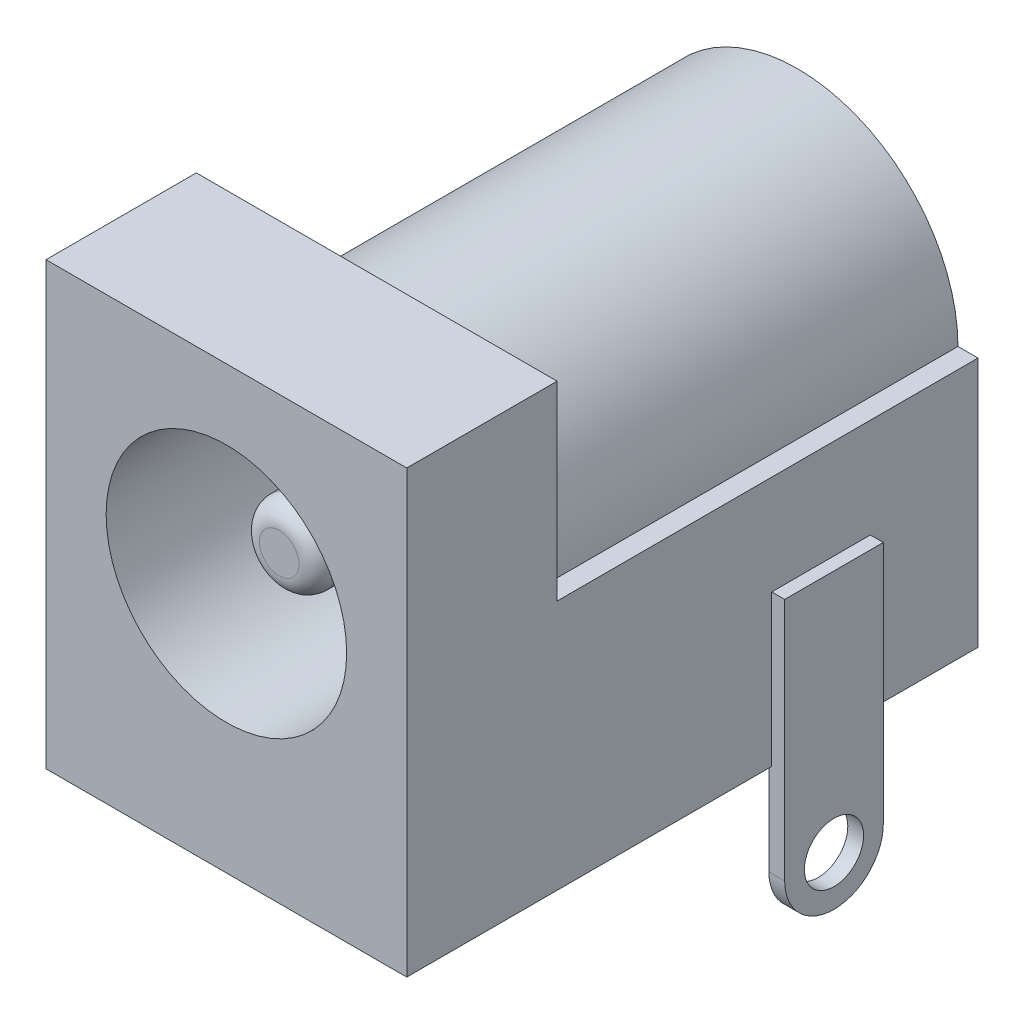
ISO-10303-21;
HEADER;
FILE_DESCRIPTION(('STEP AP214'),'2;1');
FILE_NAME('part.step','',(''),(''),'','','');
FILE_SCHEMA(('AUTOMOTIVE_DESIGN { 1 0 10303 214 1 1 1 1 }'));
ENDSEC;
DATA;
#1=APPLICATION_CONTEXT('core data for automotive mechanical design processes');
#2=APPLICATION_PROTOCOL_DEFINITION('international standard','automotive_design',2000,#1);
#3=PRODUCT_CONTEXT('',#1,'mechanical');
#4=PRODUCT('Part','Part','',(#3));
#5=PRODUCT_RELATED_PRODUCT_CATEGORY('part','',(#4));
#6=PRODUCT_DEFINITION_FORMATION('','',#4);
#7=PRODUCT_DEFINITION_CONTEXT('part definition',#1,'design');
#8=PRODUCT_DEFINITION('design','',#6,#7);
#9=PRODUCT_DEFINITION_SHAPE('','',#8);
#10=(LENGTH_UNIT() NAMED_UNIT(*) SI_UNIT(.MILLI.,.METRE.));
#11=(NAMED_UNIT(*) PLANE_ANGLE_UNIT() SI_UNIT($,.RADIAN.));
#12=(NAMED_UNIT(*) SI_UNIT($,.STERADIAN.) SOLID_ANGLE_UNIT());
#13=UNCERTAINTY_MEASURE_WITH_UNIT(LENGTH_MEASURE(1.E-05),#10,'distance_accuracy_value','');
#14=(GEOMETRIC_REPRESENTATION_CONTEXT(3) GLOBAL_UNCERTAINTY_ASSIGNED_CONTEXT((#13)) GLOBAL_UNIT_ASSIGNED_CONTEXT((#10,
#11,#12)) REPRESENTATION_CONTEXT('',''));
#15=CARTESIAN_POINT('',(0.,0.,0.));
#16=DIRECTION('',(0.,0.,1.));
#17=DIRECTION('',(1.,0.,0.));
#18=AXIS2_PLACEMENT_3D('',#15,#16,#17);
#19=CARTESIAN_POINT('',(-4.572,0.,-3.81));
#20=DIRECTION('',(0.,-1.,0.));
#21=DIRECTION('',(1.,0.,0.));
#22=AXIS2_PLACEMENT_3D('',#19,#20,#21);
#23=PLANE('',#22);
#24=DIRECTION('',(-1.,0.,0.));
#25=VECTOR('',#24,1.);
#26=CARTESIAN_POINT('',(-1.1,0.,-7.65));
#27=LINE('',#26,#25);
#28=CARTESIAN_POINT('',(1.1,0.,-7.65));
#29=VERTEX_POINT('',#28);
#30=CARTESIAN_POINT('',(-1.1,0.,-7.65));
#31=VERTEX_POINT('',#30);
#32=EDGE_CURVE('E59',#29,#31,#27,.T.);
#33=ORIENTED_EDGE('',*,*,#32,.T.);
#34=DIRECTION('',(0.,0.,-1.));
#35=VECTOR('',#34,1.);
#36=CARTESIAN_POINT('',(-1.1,0.,-7.35));
#37=LINE('',#36,#35);
#38=CARTESIAN_POINT('',(-1.1,0.,-7.35));
#39=VERTEX_POINT('',#38);
#40=EDGE_CURVE('E245',#39,#31,#37,.T.);
#41=ORIENTED_EDGE('',*,*,#40,.F.);
#42=DIRECTION('',(-1.,0.,0.));
#43=VECTOR('',#42,1.);
#44=CARTESIAN_POINT('',(-1.1,0.,-7.35));
#45=LINE('',#44,#43);
#46=CARTESIAN_POINT('',(1.1,0.,-7.35));
#47=VERTEX_POINT('',#46);
#48=EDGE_CURVE('E220',#47,#39,#45,.T.);
#49=ORIENTED_EDGE('',*,*,#48,.F.);
#50=DIRECTION('',(0.,0.,-1.));
#51=VECTOR('',#50,1.);
#52=CARTESIAN_POINT('',(1.1,0.,-7.35));
#53=LINE('',#52,#51);
#54=EDGE_CURVE('E230',#47,#29,#53,.T.);
#55=ORIENTED_EDGE('',*,*,#54,.T.);
#56=EDGE_LOOP('',(#33,#41,#49,#55));
#57=FACE_BOUND('',#56,.T.);
#58=DIRECTION('',(0.,0.,-1.));
#59=VECTOR('',#58,1.);
#60=CARTESIAN_POINT('',(4.5,0.,-3.81));
#61=LINE('',#60,#59);
#62=CARTESIAN_POINT('',(4.5,0.,-9.2499999999999));
#63=VERTEX_POINT('',#62);
#64=CARTESIAN_POINT('',(4.5,0.,-11.7499999999999));
#65=VERTEX_POINT('',#64);
#66=EDGE_CURVE('E352',#63,#65,#61,.T.);
#67=ORIENTED_EDGE('',*,*,#66,.F.);
#68=DIRECTION('',(1.,0.,0.));
#69=VECTOR('',#68,1.);
#70=CARTESIAN_POINT('',(-4.572,0.,-9.2499999999999));
#71=LINE('',#70,#69);
#72=CARTESIAN_POINT('',(4.572,0.,-9.2499999999999));
#73=VERTEX_POINT('',#72);
#74=EDGE_CURVE('E44',#63,#73,#71,.T.);
#75=ORIENTED_EDGE('',*,*,#74,.T.);
#76=DIRECTION('',(0.,0.,1.));
#77=VECTOR('',#76,1.);
#78=CARTESIAN_POINT('',(4.572,0.,-3.81));
#79=LINE('',#78,#77);
#80=CARTESIAN_POINT('',(4.572,0.,0.));
#81=VERTEX_POINT('',#80);
#82=EDGE_CURVE('E359',#73,#81,#79,.T.);
#83=ORIENTED_EDGE('',*,*,#82,.T.);
#84=DIRECTION('',(1.,0.,0.));
#85=VECTOR('',#84,1.);
#86=CARTESIAN_POINT('',(-4.572,0.,0.));
#87=LINE('',#86,#85);
#88=CARTESIAN_POINT('',(-4.572,0.,0.));
#89=VERTEX_POINT('',#88);
#90=EDGE_CURVE('E389',#89,#81,#87,.T.);
#91=ORIENTED_EDGE('',*,*,#90,.F.);
#92=DIRECTION('',(0.,0.,1.));
#93=VECTOR('',#92,1.);
#94=CARTESIAN_POINT('',(-4.572,0.,-3.81));
#95=LINE('',#94,#93);
#96=CARTESIAN_POINT('',(-4.572,0.,-14.478));
#97=VERTEX_POINT('',#96);
#98=EDGE_CURVE('E369',#97,#89,#95,.T.);
#99=ORIENTED_EDGE('',*,*,#98,.F.);
#100=DIRECTION('',(-1.,0.,0.));
#101=VECTOR('',#100,1.);
#102=CARTESIAN_POINT('',(-4.572,0.,-14.478));
#103=LINE('',#102,#101);
#104=CARTESIAN_POINT('',(4.572,0.,-14.478));
#105=VERTEX_POINT('',#104);
#106=EDGE_CURVE('E306',#105,#97,#103,.T.);
#107=ORIENTED_EDGE('',*,*,#106,.F.);
#108=CARTESIAN_POINT('',(4.572,0.,-11.7499999999999));
#109=VERTEX_POINT('',#108);
#110=EDGE_CURVE('E368',#105,#109,#79,.T.);
#111=ORIENTED_EDGE('',*,*,#110,.T.);
#112=DIRECTION('',(-1.,0.,0.));
#113=VECTOR('',#112,1.);
#114=CARTESIAN_POINT('',(-4.572,0.,-11.7499999999999));
#115=LINE('',#114,#113);
#116=EDGE_CURVE('E349',#109,#65,#115,.T.);
#117=ORIENTED_EDGE('',*,*,#116,.T.);
#118=EDGE_LOOP('',(#67,#75,#83,#91,#99,#107,#111,#117));
#119=FACE_BOUND('',#118,.T.);
#120=DIRECTION('',(-1.,0.,0.));
#121=VECTOR('',#120,1.);
#122=CARTESIAN_POINT('',(1.425,0.,-13.9));
#123=LINE('',#122,#121);
#124=CARTESIAN_POINT('',(1.425,0.,-13.9));
#125=VERTEX_POINT('',#124);
#126=CARTESIAN_POINT('',(-1.425,0.,-13.9));
#127=VERTEX_POINT('',#126);
#128=EDGE_CURVE('E51',#125,#127,#123,.T.);
#129=ORIENTED_EDGE('',*,*,#128,.T.);
#130=DIRECTION('',(0.,0.,-1.));
#131=VECTOR('',#130,1.);
#132=CARTESIAN_POINT('',(-1.425,0.,-13.5));
#133=LINE('',#132,#131);
#134=CARTESIAN_POINT('',(-1.425,0.,-13.5));
#135=VERTEX_POINT('',#134);
#136=EDGE_CURVE('E191',#135,#127,#133,.T.);
#137=ORIENTED_EDGE('',*,*,#136,.F.);
#138=DIRECTION('',(-1.,0.,0.));
#139=VECTOR('',#138,1.);
#140=CARTESIAN_POINT('',(1.425,0.,-13.5));
#141=LINE('',#140,#139);
#142=CARTESIAN_POINT('',(1.425,0.,-13.5));
#143=VERTEX_POINT('',#142);
#144=EDGE_CURVE('E197',#143,#135,#141,.T.);
#145=ORIENTED_EDGE('',*,*,#144,.F.);
#146=DIRECTION('',(0.,0.,-1.));
#147=VECTOR('',#146,1.);
#148=CARTESIAN_POINT('',(1.425,0.,-13.5));
#149=LINE('',#148,#147);
#150=EDGE_CURVE('E698',#143,#125,#149,.T.);
#151=ORIENTED_EDGE('',*,*,#150,.T.);
#152=EDGE_LOOP('',(#129,#137,#145,#151));
#153=FACE_BOUND('',#152,.T.);
#154=ADVANCED_FACE('F36',(#57,#119,#153),#23,.T.);
#155=CARTESIAN_POINT('',(4.572,0.,-3.81));
#156=DIRECTION('',(1.,0.,0.));
#157=DIRECTION('',(0.,0.,-1.));
#158=AXIS2_PLACEMENT_3D('',#155,#156,#157);
#159=PLANE('',#158);
#160=ORIENTED_EDGE('',*,*,#82,.F.);
#161=DIRECTION('',(0.,1.,0.));
#162=VECTOR('',#161,1.);
#163=CARTESIAN_POINT('',(4.572,0.,-9.2499999999999));
#164=LINE('',#163,#162);
#165=CARTESIAN_POINT('',(4.572,3.8299999999999,-9.2499999999999));
#166=VERTEX_POINT('',#165);
#167=EDGE_CURVE('E284',#73,#166,#164,.T.);
#168=ORIENTED_EDGE('',*,*,#167,.T.);
#169=DIRECTION('',(0.,0.,-1.));
#170=VECTOR('',#169,1.);
#171=CARTESIAN_POINT('',(4.572,3.8299999999999,-3.81));
#172=LINE('',#171,#170);
#173=CARTESIAN_POINT('',(4.572,3.8299999999999,-11.7499999999999));
#174=VERTEX_POINT('',#173);
#175=EDGE_CURVE('E12',#166,#174,#172,.T.);
#176=ORIENTED_EDGE('',*,*,#175,.T.);
#177=DIRECTION('',(0.,-1.,0.));
#178=VECTOR('',#177,1.);
#179=CARTESIAN_POINT('',(4.572,0.,-11.7499999999999));
#180=LINE('',#179,#178);
#181=EDGE_CURVE('E281',#174,#109,#180,.T.);
#182=ORIENTED_EDGE('',*,*,#181,.T.);
#183=ORIENTED_EDGE('',*,*,#110,.F.);
#184=DIRECTION('',(0.,-1.,0.));
#185=VECTOR('',#184,1.);
#186=CARTESIAN_POINT('',(4.572,0.,-14.478));
#187=LINE('',#186,#185);
#188=CARTESIAN_POINT('',(4.57200000000001,6.34999999999998,-14.478));
#189=VERTEX_POINT('',#188);
#190=EDGE_CURVE('E303',#189,#105,#187,.T.);
#191=ORIENTED_EDGE('',*,*,#190,.F.);
#192=DIRECTION('',(0.,0.,1.));
#193=VECTOR('',#192,1.);
#194=CARTESIAN_POINT('',(4.57200000000001,6.34999999999998,-14.478));
#195=LINE('',#194,#193);
#196=CARTESIAN_POINT('',(4.57200000000001,6.34999999999998,-3.81));
#197=VERTEX_POINT('',#196);
#198=EDGE_CURVE('E327',#189,#197,#195,.T.);
#199=ORIENTED_EDGE('',*,*,#198,.T.);
#200=DIRECTION('',(0.,1.,0.));
#201=VECTOR('',#200,1.);
#202=CARTESIAN_POINT('',(4.572,0.,-3.81));
#203=LINE('',#202,#201);
#204=CARTESIAN_POINT('',(4.572,11.176,-3.81));
#205=VERTEX_POINT('',#204);
#206=EDGE_CURVE('E324',#197,#205,#203,.T.);
#207=ORIENTED_EDGE('',*,*,#206,.T.);
#208=DIRECTION('',(0.,0.,1.));
#209=VECTOR('',#208,1.);
#210=CARTESIAN_POINT('',(4.572,11.176,-3.81));
#211=LINE('',#210,#209);
#212=CARTESIAN_POINT('',(4.572,11.176,0.));
#213=VERTEX_POINT('',#212);
#214=EDGE_CURVE('E372',#205,#213,#211,.T.);
#215=ORIENTED_EDGE('',*,*,#214,.T.);
#216=DIRECTION('',(0.,1.,0.));
#217=VECTOR('',#216,1.);
#218=CARTESIAN_POINT('',(4.572,0.,0.));
#219=LINE('',#218,#217);
#220=EDGE_CURVE('E366',#81,#213,#219,.T.);
#221=ORIENTED_EDGE('',*,*,#220,.F.);
#222=EDGE_LOOP('',(#160,#168,#176,#182,#183,#191,#199,#207,#215,#221));
#223=FACE_BOUND('',#222,.T.);
#224=ADVANCED_FACE('F364',(#223),#159,.T.);
#225=CARTESIAN_POINT('',(0.,6.35,-9.144));
#226=DIRECTION('',(0.,0.,1.));
#227=DIRECTION('',(1.,0.,0.));
#228=AXIS2_PLACEMENT_3D('',#225,#226,#227);
#229=PLANE('',#228);
#230=CARTESIAN_POINT('',(0.,6.35,-9.144));
#231=DIRECTION('',(0.,0.,1.));
#232=DIRECTION('',(1.,0.,0.));
#233=AXIS2_PLACEMENT_3D('',#230,#231,#232);
#234=CIRCLE('',#233,3.048);
#235=CARTESIAN_POINT('',(3.048,6.35,-9.144));
#236=VERTEX_POINT('',#235);
#237=EDGE_CURVE('E291',#236,#236,#234,.T.);
#238=ORIENTED_EDGE('',*,*,#237,.T.);
#239=EDGE_LOOP('',(#238));
#240=FACE_BOUND('',#239,.T.);
#241=CARTESIAN_POINT('',(0.,6.35,-9.144));
#242=DIRECTION('',(0.,0.,1.));
#243=DIRECTION('',(1.,0.,0.));
#244=AXIS2_PLACEMENT_3D('',#241,#242,#243);
#245=CIRCLE('',#244,0.999999999999999);
#246=CARTESIAN_POINT('',(0.999999999999999,6.35,-9.144));
#247=VERTEX_POINT('',#246);
#248=EDGE_CURVE('E287',#247,#247,#245,.T.);
#249=ORIENTED_EDGE('',*,*,#248,.F.);
#250=EDGE_LOOP('',(#249));
#251=FACE_BOUND('',#250,.T.);
#252=ADVANCED_FACE('F411',(#240,#251),#229,.T.);
#253=CARTESIAN_POINT('',(-4.572,0.,-3.81));
#254=DIRECTION('',(-1.,0.,0.));
#255=DIRECTION('',(0.,-1.,0.));
#256=AXIS2_PLACEMENT_3D('',#253,#254,#255);
#257=PLANE('',#256);
#258=DIRECTION('',(0.,-1.,0.));
#259=VECTOR('',#258,1.);
#260=CARTESIAN_POINT('',(-4.572,0.,0.));
#261=LINE('',#260,#259);
#262=CARTESIAN_POINT('',(-4.572,11.176,0.));
#263=VERTEX_POINT('',#262);
#264=EDGE_CURVE('E386',#263,#89,#261,.T.);
#265=ORIENTED_EDGE('',*,*,#264,.F.);
#266=DIRECTION('',(0.,0.,1.));
#267=VECTOR('',#266,1.);
#268=CARTESIAN_POINT('',(-4.572,11.176,-3.81));
#269=LINE('',#268,#267);
#270=CARTESIAN_POINT('',(-4.572,11.176,-3.81));
#271=VERTEX_POINT('',#270);
#272=EDGE_CURVE('E346',#271,#263,#269,.T.);
#273=ORIENTED_EDGE('',*,*,#272,.F.);
#274=DIRECTION('',(0.,-1.,0.));
#275=VECTOR('',#274,1.);
#276=CARTESIAN_POINT('',(-4.572,0.,-3.81));
#277=LINE('',#276,#275);
#278=CARTESIAN_POINT('',(-4.572,6.34999999999998,-3.81));
#279=VERTEX_POINT('',#278);
#280=EDGE_CURVE('E377',#271,#279,#277,.T.);
#281=ORIENTED_EDGE('',*,*,#280,.T.);
#282=DIRECTION('',(0.,0.,1.));
#283=VECTOR('',#282,1.);
#284=CARTESIAN_POINT('',(-4.57200000000001,6.34999999999997,-14.478));
#285=LINE('',#284,#283);
#286=CARTESIAN_POINT('',(-4.57200000000001,6.34999999999997,-14.478));
#287=VERTEX_POINT('',#286);
#288=EDGE_CURVE('E331',#287,#279,#285,.T.);
#289=ORIENTED_EDGE('',*,*,#288,.F.);
#290=DIRECTION('',(0.,1.,0.));
#291=VECTOR('',#290,1.);
#292=CARTESIAN_POINT('',(-4.57200000000001,6.34999999999997,-14.478));
#293=LINE('',#292,#291);
#294=EDGE_CURVE('E309',#97,#287,#293,.T.);
#295=ORIENTED_EDGE('',*,*,#294,.F.);
#296=ORIENTED_EDGE('',*,*,#98,.T.);
#297=EDGE_LOOP('',(#265,#273,#281,#289,#295,#296));
#298=FACE_BOUND('',#297,.T.);
#299=ADVANCED_FACE('F403',(#298),#257,.T.);
#300=CARTESIAN_POINT('',(-4.572,11.176,-3.81));
#301=DIRECTION('',(0.,1.,0.));
#302=DIRECTION('',(-1.,0.,0.));
#303=AXIS2_PLACEMENT_3D('',#300,#301,#302);
#304=PLANE('',#303);
#305=DIRECTION('',(-1.,0.,0.));
#306=VECTOR('',#305,1.);
#307=CARTESIAN_POINT('',(-4.572,11.176,0.));
#308=LINE('',#307,#306);
#309=EDGE_CURVE('E380',#213,#263,#308,.T.);
#310=ORIENTED_EDGE('',*,*,#309,.F.);
#311=ORIENTED_EDGE('',*,*,#214,.F.);
#312=DIRECTION('',(-1.,0.,0.));
#313=VECTOR('',#312,1.);
#314=CARTESIAN_POINT('',(-4.572,11.176,-3.81));
#315=LINE('',#314,#313);
#316=EDGE_CURVE('E373',#205,#271,#315,.T.);
#317=ORIENTED_EDGE('',*,*,#316,.T.);
#318=ORIENTED_EDGE('',*,*,#272,.T.);
#319=EDGE_LOOP('',(#310,#311,#317,#318));
#320=FACE_BOUND('',#319,.T.);
#321=ADVANCED_FACE('F400',(#320),#304,.T.);
#322=CARTESIAN_POINT('',(-4.572,11.176,-3.81));
#323=DIRECTION('',(0.,0.,-1.));
#324=DIRECTION('',(-1.,0.,0.));
#325=AXIS2_PLACEMENT_3D('',#322,#323,#324);
#326=PLANE('',#325);
#327=DIRECTION('',(1.,0.,0.));
#328=VECTOR('',#327,1.);
#329=CARTESIAN_POINT('',(-4.064,6.35,-3.81));
#330=LINE('',#329,#328);
#331=CARTESIAN_POINT('',(-4.064,6.35,-3.81));
#332=VERTEX_POINT('',#331);
#333=EDGE_CURVE('E301',#279,#332,#330,.T.);
#334=ORIENTED_EDGE('',*,*,#333,.F.);
#335=ORIENTED_EDGE('',*,*,#280,.F.);
#336=ORIENTED_EDGE('',*,*,#316,.F.);
#337=ORIENTED_EDGE('',*,*,#206,.F.);
#338=DIRECTION('',(1.,0.,0.));
#339=VECTOR('',#338,1.);
#340=CARTESIAN_POINT('',(4.064,6.35,-3.81));
#341=LINE('',#340,#339);
#342=CARTESIAN_POINT('',(4.064,6.35,-3.81));
#343=VERTEX_POINT('',#342);
#344=EDGE_CURVE('E316',#343,#197,#341,.T.);
#345=ORIENTED_EDGE('',*,*,#344,.F.);
#346=CARTESIAN_POINT('',(0.,6.35,-3.81));
#347=DIRECTION('',(0.,0.,-1.));
#348=DIRECTION('',(1.,0.,0.));
#349=AXIS2_PLACEMENT_3D('',#346,#347,#348);
#350=CIRCLE('',#349,4.064);
#351=EDGE_CURVE('E294',#332,#343,#350,.T.);
#352=ORIENTED_EDGE('',*,*,#351,.F.);
#353=EDGE_LOOP('',(#334,#335,#336,#337,#345,#352));
#354=FACE_BOUND('',#353,.T.);
#355=ADVANCED_FACE('F402',(#354),#326,.T.);
#356=CARTESIAN_POINT('',(-4.572,11.176,0.));
#357=DIRECTION('',(0.,0.,-1.));
#358=DIRECTION('',(-1.,0.,0.));
#359=AXIS2_PLACEMENT_3D('',#356,#357,#358);
#360=PLANE('',#359);
#361=CARTESIAN_POINT('',(0.,6.35,0.));
#362=DIRECTION('',(0.,0.,1.));
#363=DIRECTION('',(1.,0.,0.));
#364=AXIS2_PLACEMENT_3D('',#361,#362,#363);
#365=CIRCLE('',#364,3.048);
#366=CARTESIAN_POINT('',(3.048,6.35,0.));
#367=VERTEX_POINT('',#366);
#368=EDGE_CURVE('E290',#367,#367,#365,.T.);
#369=ORIENTED_EDGE('',*,*,#368,.F.);
#370=EDGE_LOOP('',(#369));
#371=FACE_BOUND('',#370,.T.);
#372=ORIENTED_EDGE('',*,*,#264,.T.);
#373=ORIENTED_EDGE('',*,*,#90,.T.);
#374=ORIENTED_EDGE('',*,*,#220,.T.);
#375=ORIENTED_EDGE('',*,*,#309,.T.);
#376=EDGE_LOOP('',(#372,#373,#374,#375));
#377=FACE_BOUND('',#376,.T.);
#378=ADVANCED_FACE('F399',(#371,#377),#360,.F.);
#379=CARTESIAN_POINT('',(0.,6.35,-14.478));
#380=DIRECTION('',(0.,0.,1.));
#381=DIRECTION('',(1.,0.,0.));
#382=AXIS2_PLACEMENT_3D('',#379,#380,#381);
#383=CYLINDRICAL_SURFACE('',#382,4.064);
#384=ORIENTED_EDGE('',*,*,#351,.T.);
#385=DIRECTION('',(0.,0.,1.));
#386=VECTOR('',#385,1.);
#387=CARTESIAN_POINT('',(4.064,6.35,-14.478));
#388=LINE('',#387,#386);
#389=CARTESIAN_POINT('',(4.064,6.35,-14.478));
#390=VERTEX_POINT('',#389);
#391=EDGE_CURVE('E330',#390,#343,#388,.T.);
#392=ORIENTED_EDGE('',*,*,#391,.F.);
#393=CARTESIAN_POINT('',(0.,6.35,-14.478));
#394=DIRECTION('',(0.,0.,-1.));
#395=DIRECTION('',(1.,0.,0.));
#396=AXIS2_PLACEMENT_3D('',#393,#394,#395);
#397=CIRCLE('',#396,4.064);
#398=CARTESIAN_POINT('',(-4.064,6.35,-14.478));
#399=VERTEX_POINT('',#398);
#400=EDGE_CURVE('E297',#399,#390,#397,.T.);
#401=ORIENTED_EDGE('',*,*,#400,.F.);
#402=DIRECTION('',(0.,0.,1.));
#403=VECTOR('',#402,1.);
#404=CARTESIAN_POINT('',(-4.064,6.35,-14.478));
#405=LINE('',#404,#403);
#406=EDGE_CURVE('E313',#399,#332,#405,.T.);
#407=ORIENTED_EDGE('',*,*,#406,.T.);
#408=EDGE_LOOP('',(#384,#392,#401,#407));
#409=FACE_BOUND('',#408,.T.);
#410=ADVANCED_FACE('F513',(#409),#383,.T.);
#411=CARTESIAN_POINT('',(4.064,6.35,-14.478));
#412=DIRECTION('',(0.,-1.,0.));
#413=DIRECTION('',(1.,0.,0.));
#414=AXIS2_PLACEMENT_3D('',#411,#412,#413);
#415=PLANE('',#414);
#416=ORIENTED_EDGE('',*,*,#344,.T.);
#417=ORIENTED_EDGE('',*,*,#198,.F.);
#418=DIRECTION('',(1.,0.,0.));
#419=VECTOR('',#418,1.);
#420=CARTESIAN_POINT('',(4.064,6.35,-14.478));
#421=LINE('',#420,#419);
#422=EDGE_CURVE('E300',#390,#189,#421,.T.);
#423=ORIENTED_EDGE('',*,*,#422,.F.);
#424=ORIENTED_EDGE('',*,*,#391,.T.);
#425=EDGE_LOOP('',(#416,#417,#423,#424));
#426=FACE_BOUND('',#425,.T.);
#427=ADVANCED_FACE('F509',(#426),#415,.F.);
#428=CARTESIAN_POINT('',(-4.064,6.35,-14.478));
#429=DIRECTION('',(0.,-1.,0.));
#430=DIRECTION('',(1.,0.,0.));
#431=AXIS2_PLACEMENT_3D('',#428,#429,#430);
#432=PLANE('',#431);
#433=ORIENTED_EDGE('',*,*,#333,.T.);
#434=ORIENTED_EDGE('',*,*,#406,.F.);
#435=DIRECTION('',(1.,0.,0.));
#436=VECTOR('',#435,1.);
#437=CARTESIAN_POINT('',(-4.064,6.35,-14.478));
#438=LINE('',#437,#436);
#439=EDGE_CURVE('E311',#287,#399,#438,.T.);
#440=ORIENTED_EDGE('',*,*,#439,.F.);
#441=ORIENTED_EDGE('',*,*,#288,.T.);
#442=EDGE_LOOP('',(#433,#434,#440,#441));
#443=FACE_BOUND('',#442,.T.);
#444=ADVANCED_FACE('F505',(#443),#432,.F.);
#445=CARTESIAN_POINT('',(0.,6.35,-14.478));
#446=DIRECTION('',(0.,0.,1.));
#447=DIRECTION('',(1.,0.,0.));
#448=AXIS2_PLACEMENT_3D('',#445,#446,#447);
#449=PLANE('',#448);
#450=ORIENTED_EDGE('',*,*,#400,.T.);
#451=ORIENTED_EDGE('',*,*,#422,.T.);
#452=ORIENTED_EDGE('',*,*,#190,.T.);
#453=ORIENTED_EDGE('',*,*,#106,.T.);
#454=ORIENTED_EDGE('',*,*,#294,.T.);
#455=ORIENTED_EDGE('',*,*,#439,.T.);
#456=EDGE_LOOP('',(#450,#451,#452,#453,#454,#455));
#457=FACE_BOUND('',#456,.T.);
#458=ADVANCED_FACE('F501',(#457),#449,.F.);
#459=CARTESIAN_POINT('',(0.,6.35,-9.144));
#460=DIRECTION('',(0.,0.,1.));
#461=DIRECTION('',(1.,0.,0.));
#462=AXIS2_PLACEMENT_3D('',#459,#460,#461);
#463=CYLINDRICAL_SURFACE('',#462,3.048);
#464=ORIENTED_EDGE('',*,*,#237,.F.);
#465=EDGE_LOOP('',(#464));
#466=FACE_BOUND('',#465,.T.);
#467=ORIENTED_EDGE('',*,*,#368,.T.);
#468=EDGE_LOOP('',(#467));
#469=FACE_BOUND('',#468,.T.);
#470=ADVANCED_FACE('F494',(#466,#469),#463,.F.);
#471=CARTESIAN_POINT('',(0.,6.35,2.82842712474619));
#472=DIRECTION('',(0.,0.,-1.));
#473=DIRECTION('',(-1.,0.,0.));
#474=AXIS2_PLACEMENT_3D('',#471,#472,#473);
#475=CYLINDRICAL_SURFACE('',#474,0.999999999999999);
#476=CARTESIAN_POINT('',(0.,6.35,-1.84));
#477=DIRECTION('',(0.,0.,-1.));
#478=DIRECTION('',(-1.,0.,0.));
#479=AXIS2_PLACEMENT_3D('',#476,#477,#478);
#480=CIRCLE('',#479,0.999999999999999);
#481=CARTESIAN_POINT('',(-0.999999999999999,6.35,-1.84));
#482=VERTEX_POINT('',#481);
#483=EDGE_CURVE('E342',#482,#482,#480,.T.);
#484=ORIENTED_EDGE('',*,*,#483,.T.);
#485=EDGE_LOOP('',(#484));
#486=FACE_BOUND('',#485,.T.);
#487=ORIENTED_EDGE('',*,*,#248,.T.);
#488=EDGE_LOOP('',(#487));
#489=FACE_BOUND('',#488,.T.);
#490=ADVANCED_FACE('F490',(#486,#489),#475,.T.);
#491=CARTESIAN_POINT('',(-4.572,11.176,-1.34));
#492=DIRECTION('',(0.,0.,-1.));
#493=DIRECTION('',(-1.,0.,0.));
#494=AXIS2_PLACEMENT_3D('',#491,#492,#493);
#495=PLANE('',#494);
#496=CARTESIAN_POINT('',(0.,6.35,-1.34));
#497=DIRECTION('',(0.,0.,-1.));
#498=DIRECTION('',(-1.,0.,0.));
#499=AXIS2_PLACEMENT_3D('',#496,#497,#498);
#500=CIRCLE('',#499,0.499999999999999);
#501=CARTESIAN_POINT('',(-0.499999999999999,6.35,-1.34));
#502=VERTEX_POINT('',#501);
#503=EDGE_CURVE('E345',#502,#502,#500,.F.);
#504=ORIENTED_EDGE('',*,*,#503,.T.);
#505=EDGE_LOOP('',(#504));
#506=FACE_BOUND('',#505,.T.);
#507=ADVANCED_FACE('F487',(#506),#495,.F.);
#508=CARTESIAN_POINT('',(0.,6.35,-1.84));
#509=DIRECTION('',(0.,0.,-1.));
#510=DIRECTION('',(-1.,0.,0.));
#511=AXIS2_PLACEMENT_3D('',#508,#509,#510);
#512=DEGENERATE_TOROIDAL_SURFACE('',#511,0.499999999999999,0.5,.T.);
#513=ORIENTED_EDGE('',*,*,#503,.F.);
#514=EDGE_LOOP('',(#513));
#515=FACE_BOUND('',#514,.T.);
#516=ORIENTED_EDGE('',*,*,#483,.F.);
#517=EDGE_LOOP('',(#516));
#518=FACE_BOUND('',#517,.T.);
#519=ADVANCED_FACE('F38',(#515,#518),#512,.T.);
#520=CARTESIAN_POINT('',(4.9,-2.35000000000015,-10.4999999999999));
#521=DIRECTION('',(-1.,0.,0.));
#522=DIRECTION('',(0.,0.,1.));
#523=AXIS2_PLACEMENT_3D('',#520,#521,#522);
#524=PLANE('',#523);
#525=DIRECTION('',(0.,0.,1.));
#526=VECTOR('',#525,1.);
#527=CARTESIAN_POINT('',(4.9,3.8299999999999,-9.2499999999999));
#528=LINE('',#527,#526);
#529=CARTESIAN_POINT('',(4.9,3.8299999999999,-11.7499999999999));
#530=VERTEX_POINT('',#529);
#531=CARTESIAN_POINT('',(4.9,3.8299999999999,-9.2499999999999));
#532=VERTEX_POINT('',#531);
#533=EDGE_CURVE('E255',#530,#532,#528,.T.);
#534=ORIENTED_EDGE('',*,*,#533,.T.);
#535=DIRECTION('',(0.,-1.,0.));
#536=VECTOR('',#535,1.);
#537=CARTESIAN_POINT('',(4.9,3.8299999999999,-9.2499999999999));
#538=LINE('',#537,#536);
#539=CARTESIAN_POINT('',(4.9,-2.35000000000015,-9.2499999999999));
#540=VERTEX_POINT('',#539);
#541=EDGE_CURVE('E258',#532,#540,#538,.T.);
#542=ORIENTED_EDGE('',*,*,#541,.T.);
#543=CARTESIAN_POINT('',(4.9,-2.35000000000015,-10.4999999999999));
#544=DIRECTION('',(1.,0.,0.));
#545=DIRECTION('',(0.,0.,1.));
#546=AXIS2_PLACEMENT_3D('',#543,#544,#545);
#547=CIRCLE('',#546,1.25);
#548=CARTESIAN_POINT('',(4.9,-2.35000000000015,-11.7499999999999));
#549=VERTEX_POINT('',#548);
#550=EDGE_CURVE('E261',#540,#549,#547,.T.);
#551=ORIENTED_EDGE('',*,*,#550,.T.);
#552=DIRECTION('',(0.,1.,0.));
#553=VECTOR('',#552,1.);
#554=CARTESIAN_POINT('',(4.9,3.8299999999999,-11.7499999999999));
#555=LINE('',#554,#553);
#556=EDGE_CURVE('E263',#549,#530,#555,.T.);
#557=ORIENTED_EDGE('',*,*,#556,.T.);
#558=EDGE_LOOP('',(#534,#542,#551,#557));
#559=FACE_BOUND('',#558,.T.);
#560=CARTESIAN_POINT('',(4.9,-2.35000000000015,-10.4999999999999));
#561=DIRECTION('',(1.,0.,0.));
#562=DIRECTION('',(0.,0.,-1.));
#563=AXIS2_PLACEMENT_3D('',#560,#561,#562);
#564=CIRCLE('',#563,0.75);
#565=CARTESIAN_POINT('',(4.9,-2.35000000000015,-11.2499999999999));
#566=VERTEX_POINT('',#565);
#567=EDGE_CURVE('E249',#566,#566,#564,.T.);
#568=ORIENTED_EDGE('',*,*,#567,.F.);
#569=EDGE_LOOP('',(#568));
#570=FACE_BOUND('',#569,.T.);
#571=ADVANCED_FACE('F465',(#559,#570),#524,.F.);
#572=CARTESIAN_POINT('',(4.5,-2.35000000000015,-10.4999999999999));
#573=DIRECTION('',(-1.,0.,0.));
#574=DIRECTION('',(0.,0.,1.));
#575=AXIS2_PLACEMENT_3D('',#572,#573,#574);
#576=PLANE('',#575);
#577=DIRECTION('',(0.,-1.,0.));
#578=VECTOR('',#577,1.);
#579=CARTESIAN_POINT('',(4.5,3.8299999999999,-9.2499999999999));
#580=LINE('',#579,#578);
#581=CARTESIAN_POINT('',(4.5,-2.35000000000015,-9.2499999999999));
#582=VERTEX_POINT('',#581);
#583=EDGE_CURVE('E252',#63,#582,#580,.T.);
#584=ORIENTED_EDGE('',*,*,#583,.F.);
#585=ORIENTED_EDGE('',*,*,#66,.T.);
#586=DIRECTION('',(0.,1.,0.));
#587=VECTOR('',#586,1.);
#588=CARTESIAN_POINT('',(4.5,3.8299999999999,-11.7499999999999));
#589=LINE('',#588,#587);
#590=CARTESIAN_POINT('',(4.5,-2.35000000000015,-11.7499999999999));
#591=VERTEX_POINT('',#590);
#592=EDGE_CURVE('E259',#591,#65,#589,.T.);
#593=ORIENTED_EDGE('',*,*,#592,.F.);
#594=CARTESIAN_POINT('',(4.5,-2.35000000000015,-10.4999999999999));
#595=DIRECTION('',(1.,0.,0.));
#596=DIRECTION('',(0.,0.,1.));
#597=AXIS2_PLACEMENT_3D('',#594,#595,#596);
#598=CIRCLE('',#597,1.25);
#599=EDGE_CURVE('E267',#582,#591,#598,.T.);
#600=ORIENTED_EDGE('',*,*,#599,.F.);
#601=EDGE_LOOP('',(#584,#585,#593,#600));
#602=FACE_BOUND('',#601,.T.);
#603=CARTESIAN_POINT('',(4.5,-2.35000000000015,-10.4999999999999));
#604=DIRECTION('',(1.,0.,0.));
#605=DIRECTION('',(0.,0.,-1.));
#606=AXIS2_PLACEMENT_3D('',#603,#604,#605);
#607=CIRCLE('',#606,0.75);
#608=CARTESIAN_POINT('',(4.5,-2.35000000000015,-11.2499999999999));
#609=VERTEX_POINT('',#608);
#610=EDGE_CURVE('E248',#609,#609,#607,.T.);
#611=ORIENTED_EDGE('',*,*,#610,.T.);
#612=EDGE_LOOP('',(#611));
#613=FACE_BOUND('',#612,.T.);
#614=ADVANCED_FACE('F468',(#602,#613),#576,.T.);
#615=CARTESIAN_POINT('',(4.9,3.8299999999999,-9.2499999999999));
#616=DIRECTION('',(0.,-1.,0.));
#617=DIRECTION('',(0.,0.,-1.));
#618=AXIS2_PLACEMENT_3D('',#615,#616,#617);
#619=PLANE('',#618);
#620=ORIENTED_EDGE('',*,*,#175,.F.);
#621=DIRECTION('',(-1.,0.,0.));
#622=VECTOR('',#621,1.);
#623=CARTESIAN_POINT('',(4.9,3.8299999999999,-9.2499999999999));
#624=LINE('',#623,#622);
#625=EDGE_CURVE('E278',#532,#166,#624,.T.);
#626=ORIENTED_EDGE('',*,*,#625,.F.);
#627=ORIENTED_EDGE('',*,*,#533,.F.);
#628=DIRECTION('',(-1.,0.,0.));
#629=VECTOR('',#628,1.);
#630=CARTESIAN_POINT('',(4.9,3.8299999999999,-11.7499999999999));
#631=LINE('',#630,#629);
#632=EDGE_CURVE('E265',#530,#174,#631,.T.);
#633=ORIENTED_EDGE('',*,*,#632,.T.);
#634=EDGE_LOOP('',(#620,#626,#627,#633));
#635=FACE_BOUND('',#634,.T.);
#636=ADVANCED_FACE('F472',(#635),#619,.F.);
#637=CARTESIAN_POINT('',(4.9,3.8299999999999,-9.2499999999999));
#638=DIRECTION('',(0.,0.,-1.));
#639=DIRECTION('',(0.,1.,0.));
#640=AXIS2_PLACEMENT_3D('',#637,#638,#639);
#641=PLANE('',#640);
#642=ORIENTED_EDGE('',*,*,#167,.F.);
#643=ORIENTED_EDGE('',*,*,#74,.F.);
#644=ORIENTED_EDGE('',*,*,#583,.T.);
#645=DIRECTION('',(-1.,0.,0.));
#646=VECTOR('',#645,1.);
#647=CARTESIAN_POINT('',(4.9,-2.35000000000015,-9.2499999999999));
#648=LINE('',#647,#646);
#649=EDGE_CURVE('E275',#540,#582,#648,.T.);
#650=ORIENTED_EDGE('',*,*,#649,.F.);
#651=ORIENTED_EDGE('',*,*,#541,.F.);
#652=ORIENTED_EDGE('',*,*,#625,.T.);
#653=EDGE_LOOP('',(#642,#643,#644,#650,#651,#652));
#654=FACE_BOUND('',#653,.T.);
#655=ADVANCED_FACE('F480',(#654),#641,.F.);
#656=CARTESIAN_POINT('',(4.9,-2.35000000000015,-10.4999999999999));
#657=DIRECTION('',(-1.,0.,0.));
#658=DIRECTION('',(0.,0.,1.));
#659=AXIS2_PLACEMENT_3D('',#656,#657,#658);
#660=CYLINDRICAL_SURFACE('',#659,1.25);
#661=ORIENTED_EDGE('',*,*,#599,.T.);
#662=DIRECTION('',(-1.,0.,0.));
#663=VECTOR('',#662,1.);
#664=CARTESIAN_POINT('',(4.9,-2.35000000000015,-11.7499999999999));
#665=LINE('',#664,#663);
#666=EDGE_CURVE('E272',#549,#591,#665,.T.);
#667=ORIENTED_EDGE('',*,*,#666,.F.);
#668=ORIENTED_EDGE('',*,*,#550,.F.);
#669=ORIENTED_EDGE('',*,*,#649,.T.);
#670=EDGE_LOOP('',(#661,#667,#668,#669));
#671=FACE_BOUND('',#670,.T.);
#672=ADVANCED_FACE('F476',(#671),#660,.T.);
#673=CARTESIAN_POINT('',(4.9,3.8299999999999,-11.7499999999999));
#674=DIRECTION('',(0.,0.,1.));
#675=DIRECTION('',(1.,0.,0.));
#676=AXIS2_PLACEMENT_3D('',#673,#674,#675);
#677=PLANE('',#676);
#678=ORIENTED_EDGE('',*,*,#181,.F.);
#679=ORIENTED_EDGE('',*,*,#632,.F.);
#680=ORIENTED_EDGE('',*,*,#556,.F.);
#681=ORIENTED_EDGE('',*,*,#666,.T.);
#682=ORIENTED_EDGE('',*,*,#592,.T.);
#683=ORIENTED_EDGE('',*,*,#116,.F.);
#684=EDGE_LOOP('',(#678,#679,#680,#681,#682,#683));
#685=FACE_BOUND('',#684,.T.);
#686=ADVANCED_FACE('F463',(#685),#677,.F.);
#687=CARTESIAN_POINT('',(4.9,-2.35000000000015,-10.4999999999999));
#688=DIRECTION('',(-1.,0.,0.));
#689=DIRECTION('',(0.,0.,1.));
#690=AXIS2_PLACEMENT_3D('',#687,#688,#689);
#691=CYLINDRICAL_SURFACE('',#690,0.75);
#692=ORIENTED_EDGE('',*,*,#567,.T.);
#693=EDGE_LOOP('',(#692));
#694=FACE_BOUND('',#693,.T.);
#695=ORIENTED_EDGE('',*,*,#610,.F.);
#696=EDGE_LOOP('',(#695));
#697=FACE_BOUND('',#696,.T.);
#698=ADVANCED_FACE('F441',(#694,#697),#691,.F.);
#699=CARTESIAN_POINT('',(0.,-2.5,-7.35));
#700=DIRECTION('',(0.,0.,1.));
#701=DIRECTION('',(1.,0.,0.));
#702=AXIS2_PLACEMENT_3D('',#699,#700,#701);
#703=PLANE('',#702);
#704=ORIENTED_EDGE('',*,*,#48,.T.);
#705=DIRECTION('',(0.,-1.,0.));
#706=VECTOR('',#705,1.);
#707=CARTESIAN_POINT('',(-1.1,0.,-7.35));
#708=LINE('',#707,#706);
#709=CARTESIAN_POINT('',(-1.1,-2.5,-7.35));
#710=VERTEX_POINT('',#709);
#711=EDGE_CURVE('E223',#39,#710,#708,.T.);
#712=ORIENTED_EDGE('',*,*,#711,.T.);
#713=CARTESIAN_POINT('',(0.,-2.5,-7.35));
#714=DIRECTION('',(0.,0.,1.));
#715=DIRECTION('',(1.,0.,0.));
#716=AXIS2_PLACEMENT_3D('',#713,#714,#715);
#717=CIRCLE('',#716,1.1);
#718=CARTESIAN_POINT('',(1.1,-2.5,-7.35));
#719=VERTEX_POINT('',#718);
#720=EDGE_CURVE('E226',#710,#719,#717,.T.);
#721=ORIENTED_EDGE('',*,*,#720,.T.);
#722=DIRECTION('',(0.,1.,0.));
#723=VECTOR('',#722,1.);
#724=CARTESIAN_POINT('',(1.1,0.,-7.35));
#725=LINE('',#724,#723);
#726=EDGE_CURVE('E228',#719,#47,#725,.T.);
#727=ORIENTED_EDGE('',*,*,#726,.T.);
#728=EDGE_LOOP('',(#704,#712,#721,#727));
#729=FACE_BOUND('',#728,.T.);
#730=CARTESIAN_POINT('',(0.,-2.5,-7.35));
#731=DIRECTION('',(0.,0.,1.));
#732=DIRECTION('',(1.,0.,0.));
#733=AXIS2_PLACEMENT_3D('',#730,#731,#732);
#734=CIRCLE('',#733,0.75);
#735=CARTESIAN_POINT('',(0.75,-2.5,-7.35));
#736=VERTEX_POINT('',#735);
#737=EDGE_CURVE('E212',#736,#736,#734,.T.);
#738=ORIENTED_EDGE('',*,*,#737,.F.);
#739=EDGE_LOOP('',(#738));
#740=FACE_BOUND('',#739,.T.);
#741=ADVANCED_FACE('F438',(#729,#740),#703,.T.);
#742=CARTESIAN_POINT('',(0.,-2.5,-7.65));
#743=DIRECTION('',(0.,0.,1.));
#744=DIRECTION('',(1.,0.,0.));
#745=AXIS2_PLACEMENT_3D('',#742,#743,#744);
#746=PLANE('',#745);
#747=ORIENTED_EDGE('',*,*,#32,.F.);
#748=DIRECTION('',(0.,1.,0.));
#749=VECTOR('',#748,1.);
#750=CARTESIAN_POINT('',(1.1,0.,-7.65));
#751=LINE('',#750,#749);
#752=CARTESIAN_POINT('',(1.1,-2.5,-7.65));
#753=VERTEX_POINT('',#752);
#754=EDGE_CURVE('E224',#753,#29,#751,.T.);
#755=ORIENTED_EDGE('',*,*,#754,.F.);
#756=CARTESIAN_POINT('',(0.,-2.5,-7.65));
#757=DIRECTION('',(0.,0.,1.));
#758=DIRECTION('',(1.,0.,0.));
#759=AXIS2_PLACEMENT_3D('',#756,#757,#758);
#760=CIRCLE('',#759,1.1);
#761=CARTESIAN_POINT('',(-1.1,-2.5,-7.65));
#762=VERTEX_POINT('',#761);
#763=EDGE_CURVE('E234',#762,#753,#760,.T.);
#764=ORIENTED_EDGE('',*,*,#763,.F.);
#765=DIRECTION('',(0.,-1.,0.));
#766=VECTOR('',#765,1.);
#767=CARTESIAN_POINT('',(-1.1,0.,-7.65));
#768=LINE('',#767,#766);
#769=EDGE_CURVE('E232',#31,#762,#768,.T.);
#770=ORIENTED_EDGE('',*,*,#769,.F.);
#771=EDGE_LOOP('',(#747,#755,#764,#770));
#772=FACE_BOUND('',#771,.T.);
#773=CARTESIAN_POINT('',(0.,-2.5,-7.65));
#774=DIRECTION('',(0.,0.,1.));
#775=DIRECTION('',(1.,0.,0.));
#776=AXIS2_PLACEMENT_3D('',#773,#774,#775);
#777=CIRCLE('',#776,0.75);
#778=CARTESIAN_POINT('',(0.75,-2.5,-7.65));
#779=VERTEX_POINT('',#778);
#780=EDGE_CURVE('E209',#779,#779,#777,.T.);
#781=ORIENTED_EDGE('',*,*,#780,.T.);
#782=EDGE_LOOP('',(#781));
#783=FACE_BOUND('',#782,.T.);
#784=ADVANCED_FACE('F429',(#772,#783),#746,.F.);
#785=CARTESIAN_POINT('',(-1.1,0.,-7.35));
#786=DIRECTION('',(1.,0.,0.));
#787=DIRECTION('',(0.,1.,0.));
#788=AXIS2_PLACEMENT_3D('',#785,#786,#787);
#789=PLANE('',#788);
#790=ORIENTED_EDGE('',*,*,#769,.T.);
#791=DIRECTION('',(0.,0.,-1.));
#792=VECTOR('',#791,1.);
#793=CARTESIAN_POINT('',(-1.1,-2.5,-7.35));
#794=LINE('',#793,#792);
#795=EDGE_CURVE('E242',#710,#762,#794,.T.);
#796=ORIENTED_EDGE('',*,*,#795,.F.);
#797=ORIENTED_EDGE('',*,*,#711,.F.);
#798=ORIENTED_EDGE('',*,*,#40,.T.);
#799=EDGE_LOOP('',(#790,#796,#797,#798));
#800=FACE_BOUND('',#799,.T.);
#801=ADVANCED_FACE('F436',(#800),#789,.F.);
#802=CARTESIAN_POINT('',(0.,-2.5,-7.35));
#803=DIRECTION('',(0.,0.,-1.));
#804=DIRECTION('',(-1.,0.,0.));
#805=AXIS2_PLACEMENT_3D('',#802,#803,#804);
#806=CYLINDRICAL_SURFACE('',#805,1.1);
#807=ORIENTED_EDGE('',*,*,#763,.T.);
#808=DIRECTION('',(0.,0.,-1.));
#809=VECTOR('',#808,1.);
#810=CARTESIAN_POINT('',(1.1,-2.5,-7.35));
#811=LINE('',#810,#809);
#812=EDGE_CURVE('E239',#719,#753,#811,.T.);
#813=ORIENTED_EDGE('',*,*,#812,.F.);
#814=ORIENTED_EDGE('',*,*,#720,.F.);
#815=ORIENTED_EDGE('',*,*,#795,.T.);
#816=EDGE_LOOP('',(#807,#813,#814,#815));
#817=FACE_BOUND('',#816,.T.);
#818=ADVANCED_FACE('F432',(#817),#806,.T.);
#819=CARTESIAN_POINT('',(1.1,0.,-7.35));
#820=DIRECTION('',(-1.,0.,0.));
#821=DIRECTION('',(0.,-1.,0.));
#822=AXIS2_PLACEMENT_3D('',#819,#820,#821);
#823=PLANE('',#822);
#824=ORIENTED_EDGE('',*,*,#754,.T.);
#825=ORIENTED_EDGE('',*,*,#54,.F.);
#826=ORIENTED_EDGE('',*,*,#726,.F.);
#827=ORIENTED_EDGE('',*,*,#812,.T.);
#828=EDGE_LOOP('',(#824,#825,#826,#827));
#829=FACE_BOUND('',#828,.T.);
#830=ADVANCED_FACE('F426',(#829),#823,.F.);
#831=CARTESIAN_POINT('',(0.,-2.5,-7.35));
#832=DIRECTION('',(0.,0.,-1.));
#833=DIRECTION('',(-1.,0.,0.));
#834=AXIS2_PLACEMENT_3D('',#831,#832,#833);
#835=CYLINDRICAL_SURFACE('',#834,0.75);
#836=ORIENTED_EDGE('',*,*,#737,.T.);
#837=EDGE_LOOP('',(#836));
#838=FACE_BOUND('',#837,.T.);
#839=ORIENTED_EDGE('',*,*,#780,.F.);
#840=EDGE_LOOP('',(#839));
#841=FACE_BOUND('',#840,.T.);
#842=ADVANCED_FACE('F445',(#838,#841),#835,.F.);
#843=CARTESIAN_POINT('',(0.,-2.175,-13.5));
#844=DIRECTION('',(0.,0.,-1.));
#845=DIRECTION('',(-1.,0.,0.));
#846=AXIS2_PLACEMENT_3D('',#843,#844,#845);
#847=PLANE('',#846);
#848=ORIENTED_EDGE('',*,*,#144,.T.);
#849=DIRECTION('',(0.,-1.,0.));
#850=VECTOR('',#849,1.);
#851=CARTESIAN_POINT('',(-1.425,0.,-13.5));
#852=LINE('',#851,#850);
#853=CARTESIAN_POINT('',(-1.425,-2.175,-13.5));
#854=VERTEX_POINT('',#853);
#855=EDGE_CURVE('E187',#135,#854,#852,.T.);
#856=ORIENTED_EDGE('',*,*,#855,.T.);
#857=CARTESIAN_POINT('',(0.,-2.175,-13.5));
#858=DIRECTION('',(0.,0.,1.));
#859=DIRECTION('',(-1.,0.,0.));
#860=AXIS2_PLACEMENT_3D('',#857,#858,#859);
#861=CIRCLE('',#860,1.425);
#862=CARTESIAN_POINT('',(1.425,-2.175,-13.5));
#863=VERTEX_POINT('',#862);
#864=EDGE_CURVE('E196',#854,#863,#861,.T.);
#865=ORIENTED_EDGE('',*,*,#864,.T.);
#866=DIRECTION('',(0.,1.,0.));
#867=VECTOR('',#866,1.);
#868=CARTESIAN_POINT('',(1.425,0.,-13.5));
#869=LINE('',#868,#867);
#870=EDGE_CURVE('E203',#863,#143,#869,.T.);
#871=ORIENTED_EDGE('',*,*,#870,.T.);
#872=EDGE_LOOP('',(#848,#856,#865,#871));
#873=FACE_BOUND('',#872,.T.);
#874=CARTESIAN_POINT('',(0.,-2.175,-13.5));
#875=DIRECTION('',(0.,0.,1.));
#876=DIRECTION('',(1.,0.,0.));
#877=AXIS2_PLACEMENT_3D('',#874,#875,#876);
#878=CIRCLE('',#877,0.749999999999955);
#879=CARTESIAN_POINT('',(0.749999999999955,-2.175,-13.5));
#880=VERTEX_POINT('',#879);
#881=EDGE_CURVE('E688',#880,#880,#878,.T.);
#882=ORIENTED_EDGE('',*,*,#881,.F.);
#883=EDGE_LOOP('',(#882));
#884=FACE_BOUND('',#883,.T.);
#885=ADVANCED_FACE('F200',(#873,#884),#847,.F.);
#886=CARTESIAN_POINT('',(0.,-2.175,-13.9));
#887=DIRECTION('',(0.,0.,-1.));
#888=DIRECTION('',(-1.,0.,0.));
#889=AXIS2_PLACEMENT_3D('',#886,#887,#888);
#890=PLANE('',#889);
#891=ORIENTED_EDGE('',*,*,#128,.F.);
#892=DIRECTION('',(0.,1.,0.));
#893=VECTOR('',#892,1.);
#894=CARTESIAN_POINT('',(1.425,0.,-13.9));
#895=LINE('',#894,#893);
#896=CARTESIAN_POINT('',(1.425,-2.175,-13.9));
#897=VERTEX_POINT('',#896);
#898=EDGE_CURVE('E207',#897,#125,#895,.T.);
#899=ORIENTED_EDGE('',*,*,#898,.F.);
#900=CARTESIAN_POINT('',(0.,-2.175,-13.9));
#901=DIRECTION('',(0.,0.,1.));
#902=DIRECTION('',(-1.,0.,0.));
#903=AXIS2_PLACEMENT_3D('',#900,#901,#902);
#904=CIRCLE('',#903,1.425);
#905=CARTESIAN_POINT('',(-1.425,-2.175,-13.9));
#906=VERTEX_POINT('',#905);
#907=EDGE_CURVE('E702',#906,#897,#904,.T.);
#908=ORIENTED_EDGE('',*,*,#907,.F.);
#909=DIRECTION('',(0.,-1.,0.));
#910=VECTOR('',#909,1.);
#911=CARTESIAN_POINT('',(-1.425,0.,-13.9));
#912=LINE('',#911,#910);
#913=EDGE_CURVE('E700',#127,#906,#912,.T.);
#914=ORIENTED_EDGE('',*,*,#913,.F.);
#915=EDGE_LOOP('',(#891,#899,#908,#914));
#916=FACE_BOUND('',#915,.T.);
#917=CARTESIAN_POINT('',(0.,-2.175,-13.9));
#918=DIRECTION('',(0.,0.,1.));
#919=DIRECTION('',(1.,0.,0.));
#920=AXIS2_PLACEMENT_3D('',#917,#918,#919);
#921=CIRCLE('',#920,0.749999999999955);
#922=CARTESIAN_POINT('',(0.749999999999955,-2.175,-13.9));
#923=VERTEX_POINT('',#922);
#924=EDGE_CURVE('E691',#923,#923,#921,.T.);
#925=ORIENTED_EDGE('',*,*,#924,.T.);
#926=EDGE_LOOP('',(#925));
#927=FACE_BOUND('',#926,.T.);
#928=ADVANCED_FACE('F635',(#916,#927),#890,.T.);
#929=CARTESIAN_POINT('',(-1.425,0.,-13.5));
#930=DIRECTION('',(1.,0.,0.));
#931=DIRECTION('',(0.,1.,0.));
#932=AXIS2_PLACEMENT_3D('',#929,#930,#931);
#933=PLANE('',#932);
#934=ORIENTED_EDGE('',*,*,#913,.T.);
#935=DIRECTION('',(0.,0.,-1.));
#936=VECTOR('',#935,1.);
#937=CARTESIAN_POINT('',(-1.425,-2.175,-13.5));
#938=LINE('',#937,#936);
#939=EDGE_CURVE('E193',#854,#906,#938,.T.);
#940=ORIENTED_EDGE('',*,*,#939,.F.);
#941=ORIENTED_EDGE('',*,*,#855,.F.);
#942=ORIENTED_EDGE('',*,*,#136,.T.);
#943=EDGE_LOOP('',(#934,#940,#941,#942));
#944=FACE_BOUND('',#943,.T.);
#945=ADVANCED_FACE('F189',(#944),#933,.F.);
#946=CARTESIAN_POINT('',(0.,-2.175,-13.5));
#947=DIRECTION('',(0.,0.,-1.));
#948=DIRECTION('',(-1.,0.,0.));
#949=AXIS2_PLACEMENT_3D('',#946,#947,#948);
#950=CYLINDRICAL_SURFACE('',#949,1.425);
#951=ORIENTED_EDGE('',*,*,#907,.T.);
#952=DIRECTION('',(0.,0.,-1.));
#953=VECTOR('',#952,1.);
#954=CARTESIAN_POINT('',(1.425,-2.175,-13.5));
#955=LINE('',#954,#953);
#956=EDGE_CURVE('E214',#863,#897,#955,.T.);
#957=ORIENTED_EDGE('',*,*,#956,.F.);
#958=ORIENTED_EDGE('',*,*,#864,.F.);
#959=ORIENTED_EDGE('',*,*,#939,.T.);
#960=EDGE_LOOP('',(#951,#957,#958,#959));
#961=FACE_BOUND('',#960,.T.);
#962=ADVANCED_FACE('F652',(#961),#950,.T.);
#963=CARTESIAN_POINT('',(1.425,0.,-13.5));
#964=DIRECTION('',(-1.,0.,0.));
#965=DIRECTION('',(0.,0.,1.));
#966=AXIS2_PLACEMENT_3D('',#963,#964,#965);
#967=PLANE('',#966);
#968=ORIENTED_EDGE('',*,*,#898,.T.);
#969=ORIENTED_EDGE('',*,*,#150,.F.);
#970=ORIENTED_EDGE('',*,*,#870,.F.);
#971=ORIENTED_EDGE('',*,*,#956,.T.);
#972=EDGE_LOOP('',(#968,#969,#970,#971));
#973=FACE_BOUND('',#972,.T.);
#974=ADVANCED_FACE('F661',(#973),#967,.F.);
#975=CARTESIAN_POINT('',(0.,-2.175,-13.5));
#976=DIRECTION('',(0.,0.,-1.));
#977=DIRECTION('',(-1.,0.,0.));
#978=AXIS2_PLACEMENT_3D('',#975,#976,#977);
#979=CYLINDRICAL_SURFACE('',#978,0.749999999999955);
#980=ORIENTED_EDGE('',*,*,#881,.T.);
#981=EDGE_LOOP('',(#980));
#982=FACE_BOUND('',#981,.T.);
#983=ORIENTED_EDGE('',*,*,#924,.F.);
#984=EDGE_LOOP('',(#983));
#985=FACE_BOUND('',#984,.T.);
#986=ADVANCED_FACE('F671',(#982,#985),#979,.F.);
#987=CLOSED_SHELL('',(#154,#224,#252,#299,#321,#355,#378,#410,#427,#444,#458,#470,#490,#507,
#519,#571,#614,#636,#655,#672,#686,#698,#741,#784,#801,#818,#830,#842,#885,#928,#945,#962,#974,#986));
#988=MANIFOLD_SOLID_BREP('B2',#987);
#989=ADVANCED_BREP_SHAPE_REPRESENTATION('',(#18,#988),#14);
#990=SHAPE_DEFINITION_REPRESENTATION(#9,#989);
ENDSEC;
END-ISO-10303-21;
